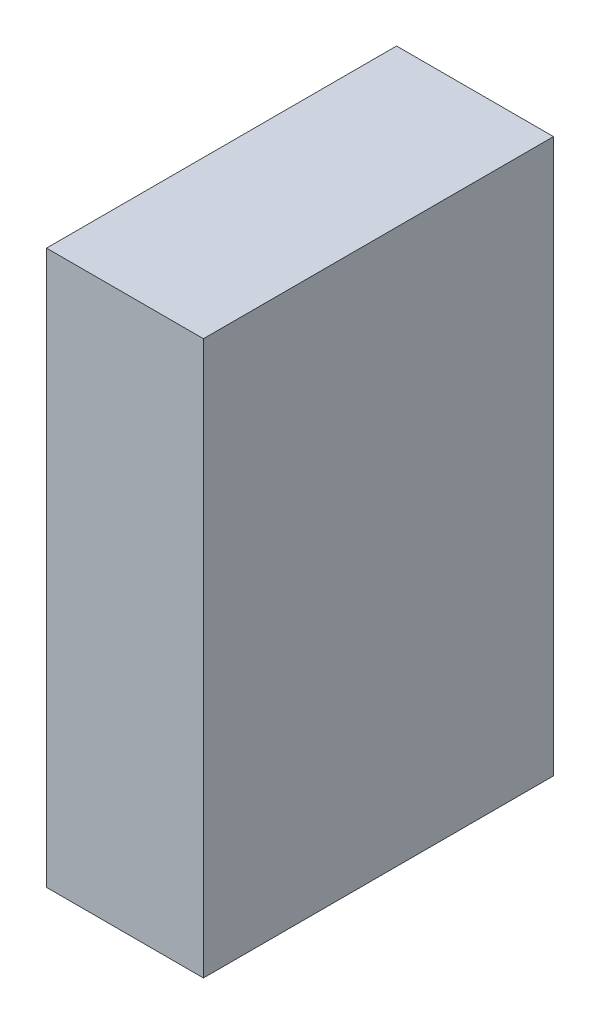
ISO-10303-21;
HEADER;
FILE_DESCRIPTION(('STEP AP214'),'2;1');
FILE_NAME('part.step','',(''),(''),'','','');
FILE_SCHEMA(('AUTOMOTIVE_DESIGN { 1 0 10303 214 1 1 1 1 }'));
ENDSEC;
DATA;
#1=APPLICATION_CONTEXT('core data for automotive mechanical design processes');
#2=APPLICATION_PROTOCOL_DEFINITION('international standard','automotive_design',2000,#1);
#3=PRODUCT_CONTEXT('',#1,'mechanical');
#4=PRODUCT('Part','Part','',(#3));
#5=PRODUCT_RELATED_PRODUCT_CATEGORY('part','',(#4));
#6=PRODUCT_DEFINITION_FORMATION('','',#4);
#7=PRODUCT_DEFINITION_CONTEXT('part definition',#1,'design');
#8=PRODUCT_DEFINITION('design','',#6,#7);
#9=PRODUCT_DEFINITION_SHAPE('','',#8);
#10=(LENGTH_UNIT() NAMED_UNIT(*) SI_UNIT(.MILLI.,.METRE.));
#11=(NAMED_UNIT(*) PLANE_ANGLE_UNIT() SI_UNIT($,.RADIAN.));
#12=(NAMED_UNIT(*) SI_UNIT($,.STERADIAN.) SOLID_ANGLE_UNIT());
#13=UNCERTAINTY_MEASURE_WITH_UNIT(LENGTH_MEASURE(1.E-05),#10,'distance_accuracy_value','');
#14=(GEOMETRIC_REPRESENTATION_CONTEXT(3) GLOBAL_UNCERTAINTY_ASSIGNED_CONTEXT((#13)) GLOBAL_UNIT_ASSIGNED_CONTEXT((#10,
#11,#12)) REPRESENTATION_CONTEXT('',''));
#15=CARTESIAN_POINT('',(0.,0.,0.));
#16=DIRECTION('',(0.,0.,1.));
#17=DIRECTION('',(1.,0.,0.));
#18=AXIS2_PLACEMENT_3D('',#15,#16,#17);
#19=CARTESIAN_POINT('',(-0.13449046,-0.47448978,0.));
#20=DIRECTION('',(-1.,0.,0.));
#21=DIRECTION('',(0.,1.,0.));
#22=AXIS2_PLACEMENT_3D('',#19,#20,#21);
#23=PLANE('',#22);
#24=DIRECTION('',(0.,0.,1.));
#25=VECTOR('',#24,1.);
#26=CARTESIAN_POINT('',(-0.13449046,-0.47448978,0.));
#27=LINE('',#26,#25);
#28=CARTESIAN_POINT('',(-0.13449046,-0.47448978,0.));
#29=VERTEX_POINT('',#28);
#30=CARTESIAN_POINT('',(-0.13449046,-0.47448978,0.5999988));
#31=VERTEX_POINT('',#30);
#32=EDGE_CURVE('E11',#29,#31,#27,.T.);
#33=ORIENTED_EDGE('',*,*,#32,.T.);
#34=DIRECTION('',(0.,1.,0.));
#35=VECTOR('',#34,1.);
#36=CARTESIAN_POINT('',(-0.13449046,-0.47448978,0.5999988));
#37=LINE('',#36,#35);
#38=CARTESIAN_POINT('',(-0.13449046,0.47449232,0.5999988));
#39=VERTEX_POINT('',#38);
#40=EDGE_CURVE('E23',#31,#39,#37,.T.);
#41=ORIENTED_EDGE('',*,*,#40,.T.);
#42=DIRECTION('',(0.,0.,1.));
#43=VECTOR('',#42,1.);
#44=CARTESIAN_POINT('',(-0.13449046,0.47449232,0.));
#45=LINE('',#44,#43);
#46=CARTESIAN_POINT('',(-0.13449046,0.47449232,0.));
#47=VERTEX_POINT('',#46);
#48=EDGE_CURVE('E84',#47,#39,#45,.T.);
#49=ORIENTED_EDGE('',*,*,#48,.F.);
#50=DIRECTION('',(0.,1.,0.));
#51=VECTOR('',#50,1.);
#52=CARTESIAN_POINT('',(-0.13449046,-0.47448978,0.));
#53=LINE('',#52,#51);
#54=EDGE_CURVE('E82',#29,#47,#53,.T.);
#55=ORIENTED_EDGE('',*,*,#54,.F.);
#56=EDGE_LOOP('',(#33,#41,#49,#55));
#57=FACE_BOUND('',#56,.T.);
#58=ADVANCED_FACE('F16',(#57),#23,.T.);
#59=CARTESIAN_POINT('',(-0.13449046,0.47449232,0.));
#60=DIRECTION('',(0.,1.,0.));
#61=DIRECTION('',(1.,0.,0.));
#62=AXIS2_PLACEMENT_3D('',#59,#60,#61);
#63=PLANE('',#62);
#64=ORIENTED_EDGE('',*,*,#48,.T.);
#65=DIRECTION('',(1.,0.,0.));
#66=VECTOR('',#65,1.);
#67=CARTESIAN_POINT('',(-0.13449046,0.47449232,0.5999988));
#68=LINE('',#67,#66);
#69=CARTESIAN_POINT('',(0.134493,0.47449232,0.5999988));
#70=VERTEX_POINT('',#69);
#71=EDGE_CURVE('E80',#39,#70,#68,.T.);
#72=ORIENTED_EDGE('',*,*,#71,.T.);
#73=DIRECTION('',(0.,0.,1.));
#74=VECTOR('',#73,1.);
#75=CARTESIAN_POINT('',(0.134493,0.47449232,0.));
#76=LINE('',#75,#74);
#77=CARTESIAN_POINT('',(0.134493,0.47449232,0.));
#78=VERTEX_POINT('',#77);
#79=EDGE_CURVE('E78',#78,#70,#76,.T.);
#80=ORIENTED_EDGE('',*,*,#79,.F.);
#81=DIRECTION('',(1.,0.,0.));
#82=VECTOR('',#81,1.);
#83=CARTESIAN_POINT('',(-0.13449046,0.47449232,0.));
#84=LINE('',#83,#82);
#85=EDGE_CURVE('E69',#47,#78,#84,.T.);
#86=ORIENTED_EDGE('',*,*,#85,.F.);
#87=EDGE_LOOP('',(#64,#72,#80,#86));
#88=FACE_BOUND('',#87,.T.);
#89=ADVANCED_FACE('F89',(#88),#63,.T.);
#90=CARTESIAN_POINT('',(0.134493,0.47449232,0.));
#91=DIRECTION('',(1.,0.,0.));
#92=DIRECTION('',(0.,-1.,0.));
#93=AXIS2_PLACEMENT_3D('',#90,#91,#92);
#94=PLANE('',#93);
#95=ORIENTED_EDGE('',*,*,#79,.T.);
#96=DIRECTION('',(0.,-1.,0.));
#97=VECTOR('',#96,1.);
#98=CARTESIAN_POINT('',(0.134493,0.47449232,0.5999988));
#99=LINE('',#98,#97);
#100=CARTESIAN_POINT('',(0.134493,-0.47448978,0.5999988));
#101=VERTEX_POINT('',#100);
#102=EDGE_CURVE('E59',#70,#101,#99,.T.);
#103=ORIENTED_EDGE('',*,*,#102,.T.);
#104=DIRECTION('',(0.,0.,1.));
#105=VECTOR('',#104,1.);
#106=CARTESIAN_POINT('',(0.134493,-0.47448978,0.));
#107=LINE('',#106,#105);
#108=CARTESIAN_POINT('',(0.134493,-0.47448978,0.));
#109=VERTEX_POINT('',#108);
#110=EDGE_CURVE('E53',#109,#101,#107,.T.);
#111=ORIENTED_EDGE('',*,*,#110,.F.);
#112=DIRECTION('',(0.,-1.,0.));
#113=VECTOR('',#112,1.);
#114=CARTESIAN_POINT('',(0.134493,0.47449232,0.));
#115=LINE('',#114,#113);
#116=EDGE_CURVE('E57',#78,#109,#115,.T.);
#117=ORIENTED_EDGE('',*,*,#116,.F.);
#118=EDGE_LOOP('',(#95,#103,#111,#117));
#119=FACE_BOUND('',#118,.T.);
#120=ADVANCED_FACE('F56',(#119),#94,.T.);
#121=CARTESIAN_POINT('',(0.134493,-0.47448978,0.));
#122=DIRECTION('',(0.,-1.,0.));
#123=DIRECTION('',(-1.,0.,0.));
#124=AXIS2_PLACEMENT_3D('',#121,#122,#123);
#125=PLANE('',#124);
#126=ORIENTED_EDGE('',*,*,#110,.T.);
#127=DIRECTION('',(-1.,0.,0.));
#128=VECTOR('',#127,1.);
#129=CARTESIAN_POINT('',(0.134493,-0.47448978,0.5999988));
#130=LINE('',#129,#128);
#131=EDGE_CURVE('E70',#101,#31,#130,.T.);
#132=ORIENTED_EDGE('',*,*,#131,.T.);
#133=ORIENTED_EDGE('',*,*,#32,.F.);
#134=DIRECTION('',(-1.,0.,0.));
#135=VECTOR('',#134,1.);
#136=CARTESIAN_POINT('',(0.134493,-0.47448978,0.));
#137=LINE('',#136,#135);
#138=EDGE_CURVE('E67',#109,#29,#137,.T.);
#139=ORIENTED_EDGE('',*,*,#138,.F.);
#140=EDGE_LOOP('',(#126,#132,#133,#139));
#141=FACE_BOUND('',#140,.T.);
#142=ADVANCED_FACE('F72',(#141),#125,.T.);
#143=CARTESIAN_POINT('',(-0.13449046,-0.47448978,0.));
#144=DIRECTION('',(0.,0.,1.));
#145=DIRECTION('',(1.,0.,0.));
#146=AXIS2_PLACEMENT_3D('',#143,#144,#145);
#147=PLANE('',#146);
#148=ORIENTED_EDGE('',*,*,#54,.T.);
#149=ORIENTED_EDGE('',*,*,#85,.T.);
#150=ORIENTED_EDGE('',*,*,#116,.T.);
#151=ORIENTED_EDGE('',*,*,#138,.T.);
#152=EDGE_LOOP('',(#148,#149,#150,#151));
#153=FACE_BOUND('',#152,.T.);
#154=ADVANCED_FACE('F66',(#153),#147,.F.);
#155=CARTESIAN_POINT('',(-0.13449046,-0.47448978,0.5999988));
#156=DIRECTION('',(0.,0.,1.));
#157=DIRECTION('',(1.,0.,0.));
#158=AXIS2_PLACEMENT_3D('',#155,#156,#157);
#159=PLANE('',#158);
#160=ORIENTED_EDGE('',*,*,#131,.F.);
#161=ORIENTED_EDGE('',*,*,#102,.F.);
#162=ORIENTED_EDGE('',*,*,#71,.F.);
#163=ORIENTED_EDGE('',*,*,#40,.F.);
#164=EDGE_LOOP('',(#160,#161,#162,#163));
#165=FACE_BOUND('',#164,.T.);
#166=ADVANCED_FACE('F90',(#165),#159,.T.);
#167=CLOSED_SHELL('',(#58,#89,#120,#142,#154,#166));
#168=MANIFOLD_SOLID_BREP('B1',#167);
#169=ADVANCED_BREP_SHAPE_REPRESENTATION('',(#18,#168),#14);
#170=SHAPE_DEFINITION_REPRESENTATION(#9,#169);
ENDSEC;
END-ISO-10303-21;
